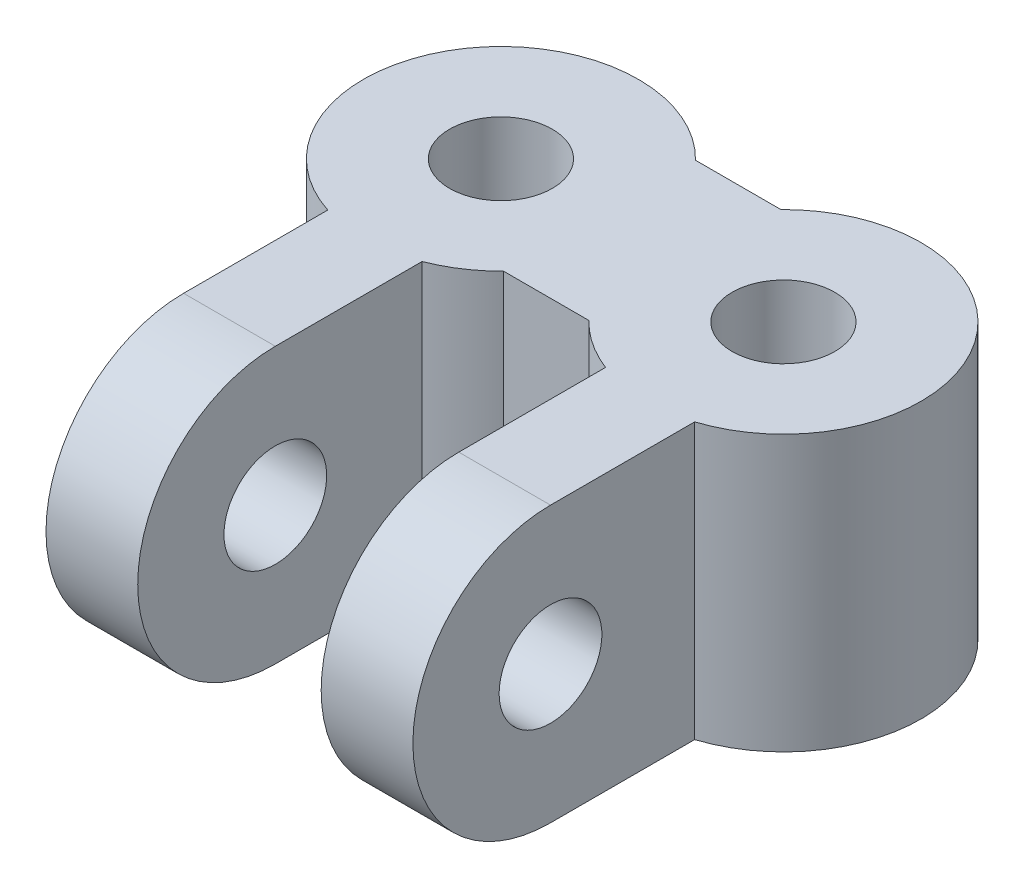
ISO-10303-21;
HEADER;
FILE_DESCRIPTION(('STEP AP214'),'2;1');
FILE_NAME('part.step','',(''),(''),'','','');
FILE_SCHEMA(('AUTOMOTIVE_DESIGN { 1 0 10303 214 1 1 1 1 }'));
ENDSEC;
DATA;
#1=APPLICATION_CONTEXT('core data for automotive mechanical design processes');
#2=APPLICATION_PROTOCOL_DEFINITION('international standard','automotive_design',2000,#1);
#3=PRODUCT_CONTEXT('',#1,'mechanical');
#4=PRODUCT('Part','Part','',(#3));
#5=PRODUCT_RELATED_PRODUCT_CATEGORY('part','',(#4));
#6=PRODUCT_DEFINITION_FORMATION('','',#4);
#7=PRODUCT_DEFINITION_CONTEXT('part definition',#1,'design');
#8=PRODUCT_DEFINITION('design','',#6,#7);
#9=PRODUCT_DEFINITION_SHAPE('','',#8);
#10=(LENGTH_UNIT() NAMED_UNIT(*) SI_UNIT(.MILLI.,.METRE.));
#11=(NAMED_UNIT(*) PLANE_ANGLE_UNIT() SI_UNIT($,.RADIAN.));
#12=(NAMED_UNIT(*) SI_UNIT($,.STERADIAN.) SOLID_ANGLE_UNIT());
#13=UNCERTAINTY_MEASURE_WITH_UNIT(LENGTH_MEASURE(1.E-05),#10,'distance_accuracy_value','');
#14=(GEOMETRIC_REPRESENTATION_CONTEXT(3) GLOBAL_UNCERTAINTY_ASSIGNED_CONTEXT((#13)) GLOBAL_UNIT_ASSIGNED_CONTEXT((#10,
#11,#12)) REPRESENTATION_CONTEXT('',''));
#15=CARTESIAN_POINT('',(0.,0.,0.));
#16=DIRECTION('',(0.,0.,1.));
#17=DIRECTION('',(1.,0.,0.));
#18=AXIS2_PLACEMENT_3D('',#15,#16,#17);
#19=CARTESIAN_POINT('',(-4.8895,9.525,0.));
#20=DIRECTION('',(0.,1.,0.));
#21=DIRECTION('',(0.,0.,1.));
#22=AXIS2_PLACEMENT_3D('',#19,#20,#21);
#23=PLANE('',#22);
#24=CARTESIAN_POINT('',(-4.8895,9.525,0.));
#25=DIRECTION('',(0.,1.,0.));
#26=DIRECTION('',(0.,0.,1.));
#27=AXIS2_PLACEMENT_3D('',#24,#25,#26);
#28=CIRCLE('',#27,1.77799999999999);
#29=CARTESIAN_POINT('',(-4.8895,9.525,1.77799999999999));
#30=VERTEX_POINT('',#29);
#31=EDGE_CURVE('E533',#30,#30,#28,.T.);
#32=ORIENTED_EDGE('',*,*,#31,.F.);
#33=EDGE_LOOP('',(#32));
#34=FACE_BOUND('',#33,.T.);
#35=CARTESIAN_POINT('',(4.8895,9.525,0.));
#36=DIRECTION('',(0.,1.,0.));
#37=DIRECTION('',(0.,0.,1.));
#38=AXIS2_PLACEMENT_3D('',#35,#36,#37);
#39=CIRCLE('',#38,1.77799999999999);
#40=CARTESIAN_POINT('',(4.8895,9.525,1.77799999999999));
#41=VERTEX_POINT('',#40);
#42=EDGE_CURVE('E536',#41,#41,#39,.T.);
#43=ORIENTED_EDGE('',*,*,#42,.F.);
#44=EDGE_LOOP('',(#43));
#45=FACE_BOUND('',#44,.T.);
#46=CARTESIAN_POINT('',(4.8895,9.525,0.));
#47=DIRECTION('',(0.,-1.,0.));
#48=DIRECTION('',(0.,0.,-1.));
#49=AXIS2_PLACEMENT_3D('',#46,#47,#48);
#50=CIRCLE('',#49,4.7625);
#51=CARTESIAN_POINT('',(1.47846558769924,9.525,-3.32359));
#52=VERTEX_POINT('',#51);
#53=CARTESIAN_POINT('',(6.35,9.525,4.53302834758399));
#54=VERTEX_POINT('',#53);
#55=EDGE_CURVE('E187',#52,#54,#50,.T.);
#56=ORIENTED_EDGE('',*,*,#55,.F.);
#57=DIRECTION('',(1.,0.,0.));
#58=VECTOR('',#57,1.);
#59=CARTESIAN_POINT('',(-1.47846558769924,9.525,-3.32359));
#60=LINE('',#59,#58);
#61=CARTESIAN_POINT('',(-1.47846558769924,9.525,-3.32359));
#62=VERTEX_POINT('',#61);
#63=EDGE_CURVE('E137',#52,#62,#60,.F.);
#64=ORIENTED_EDGE('',*,*,#63,.T.);
#65=CARTESIAN_POINT('',(-4.8895,9.525,0.));
#66=DIRECTION('',(0.,-1.,0.));
#67=DIRECTION('',(0.,0.,-1.));
#68=AXIS2_PLACEMENT_3D('',#65,#66,#67);
#69=CIRCLE('',#68,4.7625);
#70=CARTESIAN_POINT('',(-6.35,9.525,4.53302834758398));
#71=VERTEX_POINT('',#70);
#72=EDGE_CURVE('E134',#71,#62,#69,.T.);
#73=ORIENTED_EDGE('',*,*,#72,.F.);
#74=DIRECTION('',(0.,0.,-1.));
#75=VECTOR('',#74,1.);
#76=CARTESIAN_POINT('',(-6.35,9.525,4.53302834758398));
#77=LINE('',#76,#75);
#78=CARTESIAN_POINT('',(-6.35,9.525,9.52412834758399));
#79=VERTEX_POINT('',#78);
#80=EDGE_CURVE('E135',#71,#79,#77,.F.);
#81=ORIENTED_EDGE('',*,*,#80,.T.);
#82=DIRECTION('',(1.,0.,0.));
#83=VECTOR('',#82,1.);
#84=CARTESIAN_POINT('',(-4.8895,9.525,9.52412834758399));
#85=LINE('',#84,#83);
#86=CARTESIAN_POINT('',(-3.175,9.525,9.52412834758399));
#87=VERTEX_POINT('',#86);
#88=EDGE_CURVE('E154',#79,#87,#85,.T.);
#89=ORIENTED_EDGE('',*,*,#88,.T.);
#90=DIRECTION('',(0.,0.,1.));
#91=VECTOR('',#90,1.);
#92=CARTESIAN_POINT('',(-3.175,9.525,4.44318534387212));
#93=LINE('',#92,#91);
#94=CARTESIAN_POINT('',(-3.175,9.525,4.44318534387212));
#95=VERTEX_POINT('',#94);
#96=EDGE_CURVE('E209',#87,#95,#93,.F.);
#97=ORIENTED_EDGE('',*,*,#96,.T.);
#98=CARTESIAN_POINT('',(-4.8895,9.525,0.));
#99=DIRECTION('',(0.,-1.,0.));
#100=DIRECTION('',(0.,0.,-1.));
#101=AXIS2_PLACEMENT_3D('',#98,#99,#100);
#102=CIRCLE('',#101,4.7625);
#103=CARTESIAN_POINT('',(-1.47846558769924,9.525,3.32359));
#104=VERTEX_POINT('',#103);
#105=EDGE_CURVE('E208',#104,#95,#102,.T.);
#106=ORIENTED_EDGE('',*,*,#105,.F.);
#107=DIRECTION('',(-1.,0.,0.));
#108=VECTOR('',#107,1.);
#109=CARTESIAN_POINT('',(1.47846558769924,9.525,3.32359));
#110=LINE('',#109,#108);
#111=CARTESIAN_POINT('',(1.47846558769924,9.525,3.32359));
#112=VERTEX_POINT('',#111);
#113=EDGE_CURVE('E161',#104,#112,#110,.F.);
#114=ORIENTED_EDGE('',*,*,#113,.T.);
#115=CARTESIAN_POINT('',(4.8895,9.525,0.));
#116=DIRECTION('',(0.,-1.,0.));
#117=DIRECTION('',(0.,0.,-1.));
#118=AXIS2_PLACEMENT_3D('',#115,#116,#117);
#119=CIRCLE('',#118,4.7625);
#120=CARTESIAN_POINT('',(3.175,9.525,4.44318534387212));
#121=VERTEX_POINT('',#120);
#122=EDGE_CURVE('E165',#121,#112,#119,.T.);
#123=ORIENTED_EDGE('',*,*,#122,.F.);
#124=DIRECTION('',(0.,0.,-1.));
#125=VECTOR('',#124,1.);
#126=CARTESIAN_POINT('',(3.175,9.525,4.44318534387212));
#127=LINE('',#126,#125);
#128=CARTESIAN_POINT('',(3.175,9.525,9.52412834758399));
#129=VERTEX_POINT('',#128);
#130=EDGE_CURVE('E285',#121,#129,#127,.F.);
#131=ORIENTED_EDGE('',*,*,#130,.T.);
#132=DIRECTION('',(1.,0.,0.));
#133=VECTOR('',#132,1.);
#134=CARTESIAN_POINT('',(-4.8895,9.525,9.52412834758399));
#135=LINE('',#134,#133);
#136=CARTESIAN_POINT('',(6.35,9.525,9.52412834758399));
#137=VERTEX_POINT('',#136);
#138=EDGE_CURVE('E150',#129,#137,#135,.T.);
#139=ORIENTED_EDGE('',*,*,#138,.T.);
#140=DIRECTION('',(0.,0.,1.));
#141=VECTOR('',#140,1.);
#142=CARTESIAN_POINT('',(6.35,9.525,4.53302834758399));
#143=LINE('',#142,#141);
#144=EDGE_CURVE('E296',#137,#54,#143,.F.);
#145=ORIENTED_EDGE('',*,*,#144,.T.);
#146=EDGE_LOOP('',(#56,#64,#73,#81,#89,#97,#106,#114,#123,#131,#139,#145));
#147=FACE_BOUND('',#146,.T.);
#148=ADVANCED_FACE('F40',(#34,#45,#147),#23,.T.);
#149=CARTESIAN_POINT('',(-6.35,9.525,4.53302834758398));
#150=DIRECTION('',(1.,0.,0.));
#151=DIRECTION('',(0.,0.,-1.));
#152=AXIS2_PLACEMENT_3D('',#149,#150,#151);
#153=PLANE('',#152);
#154=CARTESIAN_POINT('',(-6.35,4.7625,9.52412834758399));
#155=DIRECTION('',(-1.,0.,0.));
#156=DIRECTION('',(0.,0.,1.));
#157=AXIS2_PLACEMENT_3D('',#154,#155,#156);
#158=CIRCLE('',#157,1.77799999999998);
#159=CARTESIAN_POINT('',(-6.35,4.7625,11.302128347584));
#160=VERTEX_POINT('',#159);
#161=EDGE_CURVE('E550',#160,#160,#158,.T.);
#162=ORIENTED_EDGE('',*,*,#161,.F.);
#163=EDGE_LOOP('',(#162));
#164=FACE_BOUND('',#163,.T.);
#165=CARTESIAN_POINT('',(-6.35,4.7625,9.52412834758399));
#166=DIRECTION('',(-1.,0.,0.));
#167=DIRECTION('',(0.,0.,1.));
#168=AXIS2_PLACEMENT_3D('',#165,#166,#167);
#169=CIRCLE('',#168,4.7625);
#170=CARTESIAN_POINT('',(-6.35,0.,9.52412834758399));
#171=VERTEX_POINT('',#170);
#172=EDGE_CURVE('E128',#79,#171,#169,.F.);
#173=ORIENTED_EDGE('',*,*,#172,.F.);
#174=ORIENTED_EDGE('',*,*,#80,.F.);
#175=DIRECTION('',(0.,1.,0.));
#176=VECTOR('',#175,1.);
#177=CARTESIAN_POINT('',(-6.35,9.525,4.53302834758398));
#178=LINE('',#177,#176);
#179=CARTESIAN_POINT('',(-6.35,0.,4.53302834758398));
#180=VERTEX_POINT('',#179);
#181=EDGE_CURVE('E145',#180,#71,#178,.T.);
#182=ORIENTED_EDGE('',*,*,#181,.F.);
#183=DIRECTION('',(0.,0.,1.));
#184=VECTOR('',#183,1.);
#185=CARTESIAN_POINT('',(-6.35,0.,0.));
#186=LINE('',#185,#184);
#187=EDGE_CURVE('E185',#180,#171,#186,.T.);
#188=ORIENTED_EDGE('',*,*,#187,.T.);
#189=EDGE_LOOP('',(#173,#174,#182,#188));
#190=FACE_BOUND('',#189,.T.);
#191=ADVANCED_FACE('F144',(#164,#190),#153,.F.);
#192=CARTESIAN_POINT('',(16.9992737428427,4.7625,9.52412834758399));
#193=DIRECTION('',(-1.,0.,0.));
#194=DIRECTION('',(0.,0.,1.));
#195=AXIS2_PLACEMENT_3D('',#192,#193,#194);
#196=CYLINDRICAL_SURFACE('',#195,4.7625);
#197=ORIENTED_EDGE('',*,*,#172,.T.);
#198=DIRECTION('',(1.,0.,0.));
#199=VECTOR('',#198,1.);
#200=CARTESIAN_POINT('',(-4.8895,0.,9.52412834758399));
#201=LINE('',#200,#199);
#202=CARTESIAN_POINT('',(-3.175,0.,9.52412834758399));
#203=VERTEX_POINT('',#202);
#204=EDGE_CURVE('E213',#171,#203,#201,.T.);
#205=ORIENTED_EDGE('',*,*,#204,.T.);
#206=CARTESIAN_POINT('',(-3.17499999999999,4.7625,9.52412834758399));
#207=DIRECTION('',(-1.,0.,0.));
#208=DIRECTION('',(0.,0.,1.));
#209=AXIS2_PLACEMENT_3D('',#206,#207,#208);
#210=CIRCLE('',#209,4.7625);
#211=EDGE_CURVE('E212',#203,#87,#210,.T.);
#212=ORIENTED_EDGE('',*,*,#211,.T.);
#213=ORIENTED_EDGE('',*,*,#88,.F.);
#214=EDGE_LOOP('',(#197,#205,#212,#213));
#215=FACE_BOUND('',#214,.T.);
#216=ADVANCED_FACE('F253',(#215),#196,.T.);
#217=CARTESIAN_POINT('',(-3.175,9.525,4.44318534387212));
#218=DIRECTION('',(-1.,0.,0.));
#219=DIRECTION('',(0.,0.,1.));
#220=AXIS2_PLACEMENT_3D('',#217,#218,#219);
#221=PLANE('',#220);
#222=CARTESIAN_POINT('',(-3.175,4.7625,9.52412834758399));
#223=DIRECTION('',(-1.,0.,0.));
#224=DIRECTION('',(0.,0.,1.));
#225=AXIS2_PLACEMENT_3D('',#222,#223,#224);
#226=CIRCLE('',#225,1.77799999999998);
#227=CARTESIAN_POINT('',(-3.175,4.7625,11.302128347584));
#228=VERTEX_POINT('',#227);
#229=EDGE_CURVE('E547',#228,#228,#226,.T.);
#230=ORIENTED_EDGE('',*,*,#229,.T.);
#231=EDGE_LOOP('',(#230));
#232=FACE_BOUND('',#231,.T.);
#233=DIRECTION('',(0.,-1.,0.));
#234=VECTOR('',#233,1.);
#235=CARTESIAN_POINT('',(-3.175,9.525,4.44318534387212));
#236=LINE('',#235,#234);
#237=CARTESIAN_POINT('',(-3.175,0.,4.44318534387212));
#238=VERTEX_POINT('',#237);
#239=EDGE_CURVE('E203',#95,#238,#236,.T.);
#240=ORIENTED_EDGE('',*,*,#239,.F.);
#241=ORIENTED_EDGE('',*,*,#96,.F.);
#242=ORIENTED_EDGE('',*,*,#211,.F.);
#243=DIRECTION('',(0.,0.,1.));
#244=VECTOR('',#243,1.);
#245=CARTESIAN_POINT('',(-3.175,0.,0.));
#246=LINE('',#245,#244);
#247=EDGE_CURVE('E183',#203,#238,#246,.F.);
#248=ORIENTED_EDGE('',*,*,#247,.T.);
#249=EDGE_LOOP('',(#240,#241,#242,#248));
#250=FACE_BOUND('',#249,.T.);
#251=ADVANCED_FACE('F260',(#232,#250),#221,.F.);
#252=CARTESIAN_POINT('',(-4.8895,9.525,0.));
#253=DIRECTION('',(0.,-1.,0.));
#254=DIRECTION('',(0.,0.,-1.));
#255=AXIS2_PLACEMENT_3D('',#252,#253,#254);
#256=CYLINDRICAL_SURFACE('',#255,4.7625);
#257=ORIENTED_EDGE('',*,*,#105,.T.);
#258=ORIENTED_EDGE('',*,*,#239,.T.);
#259=CARTESIAN_POINT('',(-4.8895,0.,0.));
#260=DIRECTION('',(0.,-1.,0.));
#261=DIRECTION('',(0.,0.,-1.));
#262=AXIS2_PLACEMENT_3D('',#259,#260,#261);
#263=CIRCLE('',#262,4.7625);
#264=CARTESIAN_POINT('',(-1.47846558769924,0.,3.32359));
#265=VERTEX_POINT('',#264);
#266=EDGE_CURVE('E179',#238,#265,#263,.F.);
#267=ORIENTED_EDGE('',*,*,#266,.T.);
#268=DIRECTION('',(0.,1.,0.));
#269=VECTOR('',#268,1.);
#270=CARTESIAN_POINT('',(-1.47846558769924,9.525,3.32359));
#271=LINE('',#270,#269);
#272=EDGE_CURVE('E166',#265,#104,#271,.T.);
#273=ORIENTED_EDGE('',*,*,#272,.T.);
#274=EDGE_LOOP('',(#257,#258,#267,#273));
#275=FACE_BOUND('',#274,.T.);
#276=ADVANCED_FACE('F269',(#275),#256,.T.);
#277=CARTESIAN_POINT('',(1.47846558769924,9.525,3.32359));
#278=DIRECTION('',(0.,0.,-1.));
#279=DIRECTION('',(-1.,0.,0.));
#280=AXIS2_PLACEMENT_3D('',#277,#278,#279);
#281=PLANE('',#280);
#282=DIRECTION('',(0.,-1.,0.));
#283=VECTOR('',#282,1.);
#284=CARTESIAN_POINT('',(1.47846558769924,9.525,3.32359));
#285=LINE('',#284,#283);
#286=CARTESIAN_POINT('',(1.47846558769924,0.,3.32359));
#287=VERTEX_POINT('',#286);
#288=EDGE_CURVE('E238',#112,#287,#285,.T.);
#289=ORIENTED_EDGE('',*,*,#288,.F.);
#290=ORIENTED_EDGE('',*,*,#113,.F.);
#291=ORIENTED_EDGE('',*,*,#272,.F.);
#292=DIRECTION('',(1.,0.,0.));
#293=VECTOR('',#292,1.);
#294=CARTESIAN_POINT('',(-4.8895,0.,3.32359));
#295=LINE('',#294,#293);
#296=EDGE_CURVE('E178',#265,#287,#295,.T.);
#297=ORIENTED_EDGE('',*,*,#296,.T.);
#298=EDGE_LOOP('',(#289,#290,#291,#297));
#299=FACE_BOUND('',#298,.T.);
#300=ADVANCED_FACE('F267',(#299),#281,.F.);
#301=CARTESIAN_POINT('',(4.8895,9.525,0.));
#302=DIRECTION('',(0.,-1.,0.));
#303=DIRECTION('',(0.,0.,-1.));
#304=AXIS2_PLACEMENT_3D('',#301,#302,#303);
#305=CYLINDRICAL_SURFACE('',#304,4.7625);
#306=ORIENTED_EDGE('',*,*,#122,.T.);
#307=ORIENTED_EDGE('',*,*,#288,.T.);
#308=CARTESIAN_POINT('',(4.8895,0.,0.));
#309=DIRECTION('',(0.,-1.,0.));
#310=DIRECTION('',(0.,0.,-1.));
#311=AXIS2_PLACEMENT_3D('',#308,#309,#310);
#312=CIRCLE('',#311,4.7625);
#313=CARTESIAN_POINT('',(3.175,0.,4.44318534387212));
#314=VERTEX_POINT('',#313);
#315=EDGE_CURVE('E173',#287,#314,#312,.F.);
#316=ORIENTED_EDGE('',*,*,#315,.T.);
#317=DIRECTION('',(0.,1.,0.));
#318=VECTOR('',#317,1.);
#319=CARTESIAN_POINT('',(3.175,9.525,4.44318534387212));
#320=LINE('',#319,#318);
#321=EDGE_CURVE('E281',#314,#121,#320,.T.);
#322=ORIENTED_EDGE('',*,*,#321,.T.);
#323=EDGE_LOOP('',(#306,#307,#316,#322));
#324=FACE_BOUND('',#323,.T.);
#325=ADVANCED_FACE('F339',(#324),#305,.T.);
#326=CARTESIAN_POINT('',(3.175,9.525,4.44318534387212));
#327=DIRECTION('',(1.,0.,0.));
#328=DIRECTION('',(0.,0.,-1.));
#329=AXIS2_PLACEMENT_3D('',#326,#327,#328);
#330=PLANE('',#329);
#331=CARTESIAN_POINT('',(3.175,4.7625,9.52412834758399));
#332=DIRECTION('',(-1.,0.,0.));
#333=DIRECTION('',(0.,0.,1.));
#334=AXIS2_PLACEMENT_3D('',#331,#332,#333);
#335=CIRCLE('',#334,1.77799999999998);
#336=CARTESIAN_POINT('',(3.175,4.7625,11.302128347584));
#337=VERTEX_POINT('',#336);
#338=EDGE_CURVE('E544',#337,#337,#335,.T.);
#339=ORIENTED_EDGE('',*,*,#338,.F.);
#340=EDGE_LOOP('',(#339));
#341=FACE_BOUND('',#340,.T.);
#342=CARTESIAN_POINT('',(3.175,4.7625,9.52412834758399));
#343=DIRECTION('',(-1.,0.,0.));
#344=DIRECTION('',(0.,0.,1.));
#345=AXIS2_PLACEMENT_3D('',#342,#343,#344);
#346=CIRCLE('',#345,4.7625);
#347=CARTESIAN_POINT('',(3.175,0.,9.52412834758399));
#348=VERTEX_POINT('',#347);
#349=EDGE_CURVE('E239',#129,#348,#346,.F.);
#350=ORIENTED_EDGE('',*,*,#349,.F.);
#351=ORIENTED_EDGE('',*,*,#130,.F.);
#352=ORIENTED_EDGE('',*,*,#321,.F.);
#353=DIRECTION('',(0.,0.,1.));
#354=VECTOR('',#353,1.);
#355=CARTESIAN_POINT('',(3.175,0.,0.));
#356=LINE('',#355,#354);
#357=EDGE_CURVE('E177',#314,#348,#356,.T.);
#358=ORIENTED_EDGE('',*,*,#357,.T.);
#359=EDGE_LOOP('',(#350,#351,#352,#358));
#360=FACE_BOUND('',#359,.T.);
#361=ADVANCED_FACE('F342',(#341,#360),#330,.F.);
#362=CARTESIAN_POINT('',(16.9992737428427,4.7625,9.52412834758399));
#363=DIRECTION('',(-1.,0.,0.));
#364=DIRECTION('',(0.,0.,1.));
#365=AXIS2_PLACEMENT_3D('',#362,#363,#364);
#366=CYLINDRICAL_SURFACE('',#365,4.7625);
#367=ORIENTED_EDGE('',*,*,#349,.T.);
#368=DIRECTION('',(1.,0.,0.));
#369=VECTOR('',#368,1.);
#370=CARTESIAN_POINT('',(-4.8895,0.,9.52412834758399));
#371=LINE('',#370,#369);
#372=CARTESIAN_POINT('',(6.35,0.,9.52412834758399));
#373=VERTEX_POINT('',#372);
#374=EDGE_CURVE('E325',#348,#373,#371,.T.);
#375=ORIENTED_EDGE('',*,*,#374,.T.);
#376=CARTESIAN_POINT('',(6.35,4.7625,9.52412834758399));
#377=DIRECTION('',(-1.,0.,0.));
#378=DIRECTION('',(0.,0.,1.));
#379=AXIS2_PLACEMENT_3D('',#376,#377,#378);
#380=CIRCLE('',#379,4.7625);
#381=EDGE_CURVE('E192',#373,#137,#380,.T.);
#382=ORIENTED_EDGE('',*,*,#381,.T.);
#383=ORIENTED_EDGE('',*,*,#138,.F.);
#384=EDGE_LOOP('',(#367,#375,#382,#383));
#385=FACE_BOUND('',#384,.T.);
#386=ADVANCED_FACE('F345',(#385),#366,.T.);
#387=CARTESIAN_POINT('',(6.35,9.525,4.53302834758399));
#388=DIRECTION('',(-1.,0.,0.));
#389=DIRECTION('',(0.,0.,1.));
#390=AXIS2_PLACEMENT_3D('',#387,#388,#389);
#391=PLANE('',#390);
#392=CARTESIAN_POINT('',(6.35,4.7625,9.52412834758399));
#393=DIRECTION('',(-1.,0.,0.));
#394=DIRECTION('',(0.,0.,1.));
#395=AXIS2_PLACEMENT_3D('',#392,#393,#394);
#396=CIRCLE('',#395,1.77799999999998);
#397=CARTESIAN_POINT('',(6.35,4.7625,11.302128347584));
#398=VERTEX_POINT('',#397);
#399=EDGE_CURVE('E43',#398,#398,#396,.T.);
#400=ORIENTED_EDGE('',*,*,#399,.T.);
#401=EDGE_LOOP('',(#400));
#402=FACE_BOUND('',#401,.T.);
#403=DIRECTION('',(0.,-1.,0.));
#404=VECTOR('',#403,1.);
#405=CARTESIAN_POINT('',(6.35,9.525,4.53302834758399));
#406=LINE('',#405,#404);
#407=CARTESIAN_POINT('',(6.35,0.,4.53302834758399));
#408=VERTEX_POINT('',#407);
#409=EDGE_CURVE('E191',#54,#408,#406,.T.);
#410=ORIENTED_EDGE('',*,*,#409,.F.);
#411=ORIENTED_EDGE('',*,*,#144,.F.);
#412=ORIENTED_EDGE('',*,*,#381,.F.);
#413=DIRECTION('',(0.,0.,1.));
#414=VECTOR('',#413,1.);
#415=CARTESIAN_POINT('',(6.35,0.,0.));
#416=LINE('',#415,#414);
#417=EDGE_CURVE('E172',#373,#408,#416,.F.);
#418=ORIENTED_EDGE('',*,*,#417,.T.);
#419=EDGE_LOOP('',(#410,#411,#412,#418));
#420=FACE_BOUND('',#419,.T.);
#421=ADVANCED_FACE('F322',(#402,#420),#391,.F.);
#422=CARTESIAN_POINT('',(4.8895,9.525,0.));
#423=DIRECTION('',(0.,-1.,0.));
#424=DIRECTION('',(0.,0.,-1.));
#425=AXIS2_PLACEMENT_3D('',#422,#423,#424);
#426=CYLINDRICAL_SURFACE('',#425,4.7625);
#427=CARTESIAN_POINT('',(4.8895,0.,0.));
#428=DIRECTION('',(0.,-1.,0.));
#429=DIRECTION('',(0.,0.,-1.));
#430=AXIS2_PLACEMENT_3D('',#427,#428,#429);
#431=CIRCLE('',#430,4.7625);
#432=CARTESIAN_POINT('',(1.47846558769924,0.,-3.32359));
#433=VERTEX_POINT('',#432);
#434=EDGE_CURVE('E50',#408,#433,#431,.F.);
#435=ORIENTED_EDGE('',*,*,#434,.T.);
#436=DIRECTION('',(0.,1.,0.));
#437=VECTOR('',#436,1.);
#438=CARTESIAN_POINT('',(1.47846558769924,9.525,-3.32359));
#439=LINE('',#438,#437);
#440=EDGE_CURVE('E159',#433,#52,#439,.T.);
#441=ORIENTED_EDGE('',*,*,#440,.T.);
#442=ORIENTED_EDGE('',*,*,#55,.T.);
#443=ORIENTED_EDGE('',*,*,#409,.T.);
#444=EDGE_LOOP('',(#435,#441,#442,#443));
#445=FACE_BOUND('',#444,.T.);
#446=ADVANCED_FACE('F312',(#445),#426,.T.);
#447=CARTESIAN_POINT('',(-1.47846558769924,9.525,-3.32359));
#448=DIRECTION('',(0.,0.,1.));
#449=DIRECTION('',(1.,0.,0.));
#450=AXIS2_PLACEMENT_3D('',#447,#448,#449);
#451=PLANE('',#450);
#452=DIRECTION('',(0.,-1.,0.));
#453=VECTOR('',#452,1.);
#454=CARTESIAN_POINT('',(-1.47846558769924,9.525,-3.32359));
#455=LINE('',#454,#453);
#456=CARTESIAN_POINT('',(-1.47846558769924,0.,-3.32359));
#457=VERTEX_POINT('',#456);
#458=EDGE_CURVE('E142',#62,#457,#455,.T.);
#459=ORIENTED_EDGE('',*,*,#458,.F.);
#460=ORIENTED_EDGE('',*,*,#63,.F.);
#461=ORIENTED_EDGE('',*,*,#440,.F.);
#462=DIRECTION('',(1.,0.,0.));
#463=VECTOR('',#462,1.);
#464=CARTESIAN_POINT('',(-4.8895,0.,-3.32359));
#465=LINE('',#464,#463);
#466=EDGE_CURVE('E12',#433,#457,#465,.F.);
#467=ORIENTED_EDGE('',*,*,#466,.T.);
#468=EDGE_LOOP('',(#459,#460,#461,#467));
#469=FACE_BOUND('',#468,.T.);
#470=ADVANCED_FACE('F315',(#469),#451,.F.);
#471=CARTESIAN_POINT('',(-4.8895,9.525,0.));
#472=DIRECTION('',(0.,-1.,0.));
#473=DIRECTION('',(0.,0.,-1.));
#474=AXIS2_PLACEMENT_3D('',#471,#472,#473);
#475=CYLINDRICAL_SURFACE('',#474,4.7625);
#476=ORIENTED_EDGE('',*,*,#458,.T.);
#477=CARTESIAN_POINT('',(-4.8895,0.,0.));
#478=DIRECTION('',(0.,-1.,0.));
#479=DIRECTION('',(0.,0.,-1.));
#480=AXIS2_PLACEMENT_3D('',#477,#478,#479);
#481=CIRCLE('',#480,4.7625);
#482=EDGE_CURVE('E59',#457,#180,#481,.F.);
#483=ORIENTED_EDGE('',*,*,#482,.T.);
#484=ORIENTED_EDGE('',*,*,#181,.T.);
#485=ORIENTED_EDGE('',*,*,#72,.T.);
#486=EDGE_LOOP('',(#476,#483,#484,#485));
#487=FACE_BOUND('',#486,.T.);
#488=ADVANCED_FACE('F148',(#487),#475,.T.);
#489=CARTESIAN_POINT('',(-4.8895,0.,0.));
#490=DIRECTION('',(0.,1.,0.));
#491=DIRECTION('',(0.,0.,1.));
#492=AXIS2_PLACEMENT_3D('',#489,#490,#491);
#493=PLANE('',#492);
#494=CARTESIAN_POINT('',(-4.8895,0.,0.));
#495=DIRECTION('',(0.,1.,0.));
#496=DIRECTION('',(0.,0.,1.));
#497=AXIS2_PLACEMENT_3D('',#494,#495,#496);
#498=CIRCLE('',#497,1.77799999999998);
#499=CARTESIAN_POINT('',(-4.8895,0.,1.77799999999998));
#500=VERTEX_POINT('',#499);
#501=EDGE_CURVE('E538',#500,#500,#498,.T.);
#502=ORIENTED_EDGE('',*,*,#501,.T.);
#503=EDGE_LOOP('',(#502));
#504=FACE_BOUND('',#503,.T.);
#505=CARTESIAN_POINT('',(4.8895,0.,0.));
#506=DIRECTION('',(0.,1.,0.));
#507=DIRECTION('',(0.,0.,1.));
#508=AXIS2_PLACEMENT_3D('',#505,#506,#507);
#509=CIRCLE('',#508,1.77799999999998);
#510=CARTESIAN_POINT('',(4.8895,0.,1.77799999999998));
#511=VERTEX_POINT('',#510);
#512=EDGE_CURVE('E169',#511,#511,#509,.T.);
#513=ORIENTED_EDGE('',*,*,#512,.T.);
#514=EDGE_LOOP('',(#513));
#515=FACE_BOUND('',#514,.T.);
#516=ORIENTED_EDGE('',*,*,#466,.F.);
#517=ORIENTED_EDGE('',*,*,#434,.F.);
#518=ORIENTED_EDGE('',*,*,#417,.F.);
#519=ORIENTED_EDGE('',*,*,#374,.F.);
#520=ORIENTED_EDGE('',*,*,#357,.F.);
#521=ORIENTED_EDGE('',*,*,#315,.F.);
#522=ORIENTED_EDGE('',*,*,#296,.F.);
#523=ORIENTED_EDGE('',*,*,#266,.F.);
#524=ORIENTED_EDGE('',*,*,#247,.F.);
#525=ORIENTED_EDGE('',*,*,#204,.F.);
#526=ORIENTED_EDGE('',*,*,#187,.F.);
#527=ORIENTED_EDGE('',*,*,#482,.F.);
#528=EDGE_LOOP('',(#516,#517,#518,#519,#520,#521,#522,#523,#524,#525,#526,#527));
#529=FACE_BOUND('',#528,.T.);
#530=ADVANCED_FACE('F255',(#504,#515,#529),#493,.F.);
#531=CARTESIAN_POINT('',(4.8895,9.525,0.));
#532=DIRECTION('',(0.,1.,0.));
#533=DIRECTION('',(0.,0.,1.));
#534=AXIS2_PLACEMENT_3D('',#531,#532,#533);
#535=CYLINDRICAL_SURFACE('',#534,1.77799999999999);
#536=ORIENTED_EDGE('',*,*,#512,.F.);
#537=EDGE_LOOP('',(#536));
#538=FACE_BOUND('',#537,.T.);
#539=ORIENTED_EDGE('',*,*,#42,.T.);
#540=EDGE_LOOP('',(#539));
#541=FACE_BOUND('',#540,.T.);
#542=ADVANCED_FACE('F357',(#538,#541),#535,.F.);
#543=CARTESIAN_POINT('',(-4.8895,9.525,0.));
#544=DIRECTION('',(0.,1.,0.));
#545=DIRECTION('',(0.,0.,1.));
#546=AXIS2_PLACEMENT_3D('',#543,#544,#545);
#547=CYLINDRICAL_SURFACE('',#546,1.77799999999999);
#548=ORIENTED_EDGE('',*,*,#501,.F.);
#549=EDGE_LOOP('',(#548));
#550=FACE_BOUND('',#549,.T.);
#551=ORIENTED_EDGE('',*,*,#31,.T.);
#552=EDGE_LOOP('',(#551));
#553=FACE_BOUND('',#552,.T.);
#554=ADVANCED_FACE('F364',(#550,#553),#547,.F.);
#555=CARTESIAN_POINT('',(3.175,4.7625,9.52412834758399));
#556=DIRECTION('',(-1.,0.,0.));
#557=DIRECTION('',(0.,0.,1.));
#558=AXIS2_PLACEMENT_3D('',#555,#556,#557);
#559=CYLINDRICAL_SURFACE('',#558,1.77799999999998);
#560=ORIENTED_EDGE('',*,*,#338,.T.);
#561=EDGE_LOOP('',(#560));
#562=FACE_BOUND('',#561,.T.);
#563=ORIENTED_EDGE('',*,*,#399,.F.);
#564=EDGE_LOOP('',(#563));
#565=FACE_BOUND('',#564,.T.);
#566=ADVANCED_FACE('F436',(#562,#565),#559,.F.);
#567=CARTESIAN_POINT('',(-6.35,4.7625,9.52412834758399));
#568=DIRECTION('',(-1.,0.,0.));
#569=DIRECTION('',(0.,0.,1.));
#570=AXIS2_PLACEMENT_3D('',#567,#568,#569);
#571=CYLINDRICAL_SURFACE('',#570,1.77799999999998);
#572=ORIENTED_EDGE('',*,*,#161,.T.);
#573=EDGE_LOOP('',(#572));
#574=FACE_BOUND('',#573,.T.);
#575=ORIENTED_EDGE('',*,*,#229,.F.);
#576=EDGE_LOOP('',(#575));
#577=FACE_BOUND('',#576,.T.);
#578=ADVANCED_FACE('F445',(#574,#577),#571,.F.);
#579=CLOSED_SHELL('',(#148,#191,#216,#251,#276,#300,#325,#361,#386,#421,#446,#470,#488,#530,
#542,#554,#566,#578));
#580=MANIFOLD_SOLID_BREP('B2',#579);
#581=ADVANCED_BREP_SHAPE_REPRESENTATION('',(#18,#580),#14);
#582=SHAPE_DEFINITION_REPRESENTATION(#9,#581);
ENDSEC;
END-ISO-10303-21;
